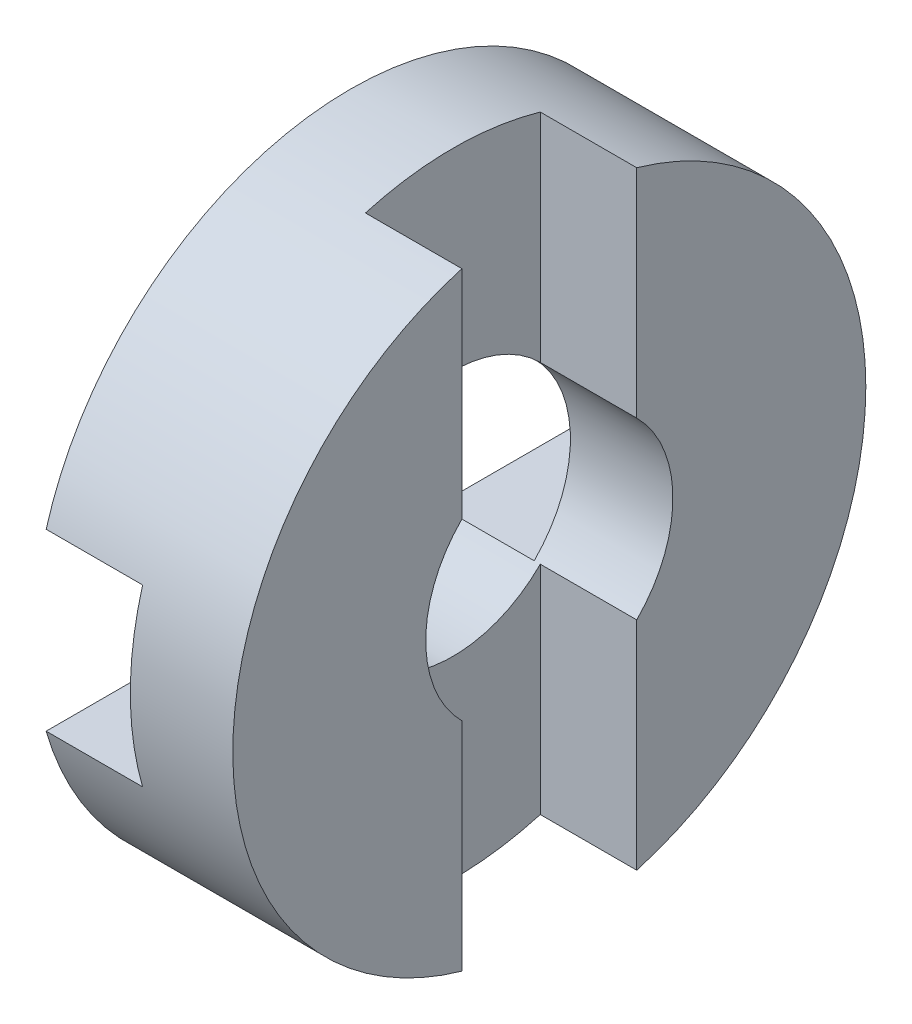
ISO-10303-21;
HEADER;
FILE_DESCRIPTION(('STEP AP214'),'2;1');
FILE_NAME('part.step','',(''),(''),'','','');
FILE_SCHEMA(('AUTOMOTIVE_DESIGN { 1 0 10303 214 1 1 1 1 }'));
ENDSEC;
DATA;
#1=APPLICATION_CONTEXT('core data for automotive mechanical design processes');
#2=APPLICATION_PROTOCOL_DEFINITION('international standard','automotive_design',2000,#1);
#3=PRODUCT_CONTEXT('',#1,'mechanical');
#4=PRODUCT('Part','Part','',(#3));
#5=PRODUCT_RELATED_PRODUCT_CATEGORY('part','',(#4));
#6=PRODUCT_DEFINITION_FORMATION('','',#4);
#7=PRODUCT_DEFINITION_CONTEXT('part definition',#1,'design');
#8=PRODUCT_DEFINITION('design','',#6,#7);
#9=PRODUCT_DEFINITION_SHAPE('','',#8);
#10=(LENGTH_UNIT() NAMED_UNIT(*) SI_UNIT(.MILLI.,.METRE.));
#11=(NAMED_UNIT(*) PLANE_ANGLE_UNIT() SI_UNIT($,.RADIAN.));
#12=(NAMED_UNIT(*) SI_UNIT($,.STERADIAN.) SOLID_ANGLE_UNIT());
#13=UNCERTAINTY_MEASURE_WITH_UNIT(LENGTH_MEASURE(1.E-05),#10,'distance_accuracy_value','');
#14=(GEOMETRIC_REPRESENTATION_CONTEXT(3) GLOBAL_UNCERTAINTY_ASSIGNED_CONTEXT((#13)) GLOBAL_UNIT_ASSIGNED_CONTEXT((#10,
#11,#12)) REPRESENTATION_CONTEXT('',''));
#15=CARTESIAN_POINT('',(0.,0.,0.));
#16=DIRECTION('',(0.,0.,1.));
#17=DIRECTION('',(1.,0.,0.));
#18=AXIS2_PLACEMENT_3D('',#15,#16,#17);
#19=CARTESIAN_POINT('',(6.6,0.,0.));
#20=DIRECTION('',(-1.,0.,0.));
#21=DIRECTION('',(0.,0.,1.));
#22=AXIS2_PLACEMENT_3D('',#19,#20,#21);
#23=CYLINDRICAL_SURFACE('',#22,10.5);
#24=CARTESIAN_POINT('',(3.2,0.,0.));
#25=DIRECTION('',(-1.,0.,0.));
#26=DIRECTION('',(0.,0.,1.));
#27=AXIS2_PLACEMENT_3D('',#24,#25,#26);
#28=CIRCLE('',#27,10.5);
#29=CARTESIAN_POINT('',(3.2,-2.9,10.0915806492343));
#30=VERTEX_POINT('',#29);
#31=CARTESIAN_POINT('',(3.2,2.9,10.0915806492343));
#32=VERTEX_POINT('',#31);
#33=EDGE_CURVE('E198',#30,#32,#28,.T.);
#34=ORIENTED_EDGE('',*,*,#33,.F.);
#35=DIRECTION('',(-1.,0.,0.));
#36=VECTOR('',#35,1.);
#37=CARTESIAN_POINT('',(6.6,-2.9,10.0915806492343));
#38=LINE('',#37,#36);
#39=CARTESIAN_POINT('',(0.,-2.9,10.0915806492343));
#40=VERTEX_POINT('',#39);
#41=EDGE_CURVE('E201',#40,#30,#38,.F.);
#42=ORIENTED_EDGE('',*,*,#41,.F.);
#43=CARTESIAN_POINT('',(0.,0.,0.));
#44=DIRECTION('',(-1.,0.,0.));
#45=DIRECTION('',(0.,0.,1.));
#46=AXIS2_PLACEMENT_3D('',#43,#44,#45);
#47=CIRCLE('',#46,10.5);
#48=CARTESIAN_POINT('',(0.,-2.9,-10.0915806492343));
#49=VERTEX_POINT('',#48);
#50=EDGE_CURVE('E215',#49,#40,#47,.T.);
#51=ORIENTED_EDGE('',*,*,#50,.F.);
#52=DIRECTION('',(-1.,0.,0.));
#53=VECTOR('',#52,1.);
#54=CARTESIAN_POINT('',(6.6,-2.9,-10.0915806492343));
#55=LINE('',#54,#53);
#56=CARTESIAN_POINT('',(3.2,-2.9,-10.0915806492343));
#57=VERTEX_POINT('',#56);
#58=EDGE_CURVE('E204',#57,#49,#55,.T.);
#59=ORIENTED_EDGE('',*,*,#58,.F.);
#60=CARTESIAN_POINT('',(3.2,2.9,-10.0915806492343));
#61=VERTEX_POINT('',#60);
#62=EDGE_CURVE('E199',#61,#57,#28,.T.);
#63=ORIENTED_EDGE('',*,*,#62,.F.);
#64=DIRECTION('',(-1.,0.,0.));
#65=VECTOR('',#64,1.);
#66=CARTESIAN_POINT('',(6.6,2.9,-10.0915806492343));
#67=LINE('',#66,#65);
#68=CARTESIAN_POINT('',(0.,2.9,-10.0915806492343));
#69=VERTEX_POINT('',#68);
#70=EDGE_CURVE('E194',#69,#61,#67,.F.);
#71=ORIENTED_EDGE('',*,*,#70,.F.);
#72=CARTESIAN_POINT('',(0.,2.9,10.0915806492343));
#73=VERTEX_POINT('',#72);
#74=EDGE_CURVE('E219',#73,#69,#47,.T.);
#75=ORIENTED_EDGE('',*,*,#74,.F.);
#76=DIRECTION('',(-1.,0.,0.));
#77=VECTOR('',#76,1.);
#78=CARTESIAN_POINT('',(6.6,2.9,10.0915806492343));
#79=LINE('',#78,#77);
#80=EDGE_CURVE('E196',#32,#73,#79,.T.);
#81=ORIENTED_EDGE('',*,*,#80,.F.);
#82=EDGE_LOOP('',(#34,#42,#51,#59,#63,#71,#75,#81));
#83=FACE_BOUND('',#82,.T.);
#84=DIRECTION('',(-1.,0.,0.));
#85=VECTOR('',#84,1.);
#86=CARTESIAN_POINT('',(6.6,10.0915806492343,-2.9));
#87=LINE('',#86,#85);
#88=CARTESIAN_POINT('',(6.6,10.0915806492343,-2.9));
#89=VERTEX_POINT('',#88);
#90=CARTESIAN_POINT('',(3.4,10.0915806492343,-2.9));
#91=VERTEX_POINT('',#90);
#92=EDGE_CURVE('E178',#89,#91,#87,.T.);
#93=ORIENTED_EDGE('',*,*,#92,.F.);
#94=CARTESIAN_POINT('',(6.6,0.,0.));
#95=DIRECTION('',(-1.,0.,0.));
#96=DIRECTION('',(0.,0.,1.));
#97=AXIS2_PLACEMENT_3D('',#94,#95,#96);
#98=CIRCLE('',#97,10.5);
#99=CARTESIAN_POINT('',(6.6,-10.0915806492343,-2.9));
#100=VERTEX_POINT('',#99);
#101=EDGE_CURVE('E207',#89,#100,#98,.T.);
#102=ORIENTED_EDGE('',*,*,#101,.T.);
#103=DIRECTION('',(-1.,0.,0.));
#104=VECTOR('',#103,1.);
#105=CARTESIAN_POINT('',(6.6,-10.0915806492343,-2.9));
#106=LINE('',#105,#104);
#107=CARTESIAN_POINT('',(3.4,-10.0915806492343,-2.9));
#108=VERTEX_POINT('',#107);
#109=EDGE_CURVE('E176',#108,#100,#106,.F.);
#110=ORIENTED_EDGE('',*,*,#109,.F.);
#111=CARTESIAN_POINT('',(3.4,0.,0.));
#112=DIRECTION('',(1.,0.,0.));
#113=DIRECTION('',(0.,0.,-1.));
#114=AXIS2_PLACEMENT_3D('',#111,#112,#113);
#115=CIRCLE('',#114,10.5);
#116=CARTESIAN_POINT('',(3.4,-10.0915806492343,2.9));
#117=VERTEX_POINT('',#116);
#118=EDGE_CURVE('E154',#117,#108,#115,.T.);
#119=ORIENTED_EDGE('',*,*,#118,.F.);
#120=DIRECTION('',(-1.,0.,0.));
#121=VECTOR('',#120,1.);
#122=CARTESIAN_POINT('',(6.6,-10.0915806492343,2.9));
#123=LINE('',#122,#121);
#124=CARTESIAN_POINT('',(6.6,-10.0915806492343,2.9));
#125=VERTEX_POINT('',#124);
#126=EDGE_CURVE('E166',#125,#117,#123,.T.);
#127=ORIENTED_EDGE('',*,*,#126,.F.);
#128=CARTESIAN_POINT('',(6.6,10.0915806492343,2.9));
#129=VERTEX_POINT('',#128);
#130=EDGE_CURVE('E165',#125,#129,#98,.T.);
#131=ORIENTED_EDGE('',*,*,#130,.T.);
#132=DIRECTION('',(-1.,0.,0.));
#133=VECTOR('',#132,1.);
#134=CARTESIAN_POINT('',(6.6,10.0915806492343,2.9));
#135=LINE('',#134,#133);
#136=CARTESIAN_POINT('',(3.4,10.0915806492343,2.9));
#137=VERTEX_POINT('',#136);
#138=EDGE_CURVE('E53',#137,#129,#135,.F.);
#139=ORIENTED_EDGE('',*,*,#138,.F.);
#140=EDGE_CURVE('E145',#91,#137,#115,.T.);
#141=ORIENTED_EDGE('',*,*,#140,.F.);
#142=EDGE_LOOP('',(#93,#102,#110,#119,#127,#131,#139,#141));
#143=FACE_BOUND('',#142,.T.);
#144=ADVANCED_FACE('F31',(#83,#143),#23,.T.);
#145=CARTESIAN_POINT('',(6.6,0.,0.));
#146=DIRECTION('',(-1.,0.,0.));
#147=DIRECTION('',(0.,0.,1.));
#148=AXIS2_PLACEMENT_3D('',#145,#146,#147);
#149=CYLINDRICAL_SURFACE('',#148,4.1);
#150=DIRECTION('',(-1.,0.,0.));
#151=VECTOR('',#150,1.);
#152=CARTESIAN_POINT('',(6.6,-2.9,2.89827534923789));
#153=LINE('',#152,#151);
#154=CARTESIAN_POINT('',(3.2,-2.9,2.89827534923789));
#155=VERTEX_POINT('',#154);
#156=CARTESIAN_POINT('',(0.,-2.9,2.89827534923789));
#157=VERTEX_POINT('',#156);
#158=EDGE_CURVE('E230',#155,#157,#153,.T.);
#159=ORIENTED_EDGE('',*,*,#158,.F.);
#160=CARTESIAN_POINT('',(3.2,0.,0.));
#161=DIRECTION('',(-1.,0.,0.));
#162=DIRECTION('',(0.,0.,1.));
#163=AXIS2_PLACEMENT_3D('',#160,#161,#162);
#164=CIRCLE('',#163,4.1);
#165=CARTESIAN_POINT('',(3.2,2.9,2.89827534923789));
#166=VERTEX_POINT('',#165);
#167=EDGE_CURVE('E226',#166,#155,#164,.F.);
#168=ORIENTED_EDGE('',*,*,#167,.F.);
#169=DIRECTION('',(-1.,0.,0.));
#170=VECTOR('',#169,1.);
#171=CARTESIAN_POINT('',(6.6,2.9,2.89827534923789));
#172=LINE('',#171,#170);
#173=CARTESIAN_POINT('',(0.,2.9,2.89827534923789));
#174=VERTEX_POINT('',#173);
#175=EDGE_CURVE('E228',#174,#166,#172,.F.);
#176=ORIENTED_EDGE('',*,*,#175,.F.);
#177=CARTESIAN_POINT('',(0.,0.,0.));
#178=DIRECTION('',(-1.,0.,0.));
#179=DIRECTION('',(0.,0.,1.));
#180=AXIS2_PLACEMENT_3D('',#177,#178,#179);
#181=CIRCLE('',#180,4.1);
#182=CARTESIAN_POINT('',(0.,2.9,-2.89827534923789));
#183=VERTEX_POINT('',#182);
#184=EDGE_CURVE('E212',#174,#183,#181,.T.);
#185=ORIENTED_EDGE('',*,*,#184,.T.);
#186=DIRECTION('',(-1.,0.,0.));
#187=VECTOR('',#186,1.);
#188=CARTESIAN_POINT('',(6.6,2.9,-2.89827534923789));
#189=LINE('',#188,#187);
#190=CARTESIAN_POINT('',(3.2,2.9,-2.89827534923789));
#191=VERTEX_POINT('',#190);
#192=EDGE_CURVE('E220',#191,#183,#189,.T.);
#193=ORIENTED_EDGE('',*,*,#192,.F.);
#194=CARTESIAN_POINT('',(3.2,-2.9,-2.89827534923789));
#195=VERTEX_POINT('',#194);
#196=EDGE_CURVE('E222',#195,#191,#164,.F.);
#197=ORIENTED_EDGE('',*,*,#196,.F.);
#198=DIRECTION('',(-1.,0.,0.));
#199=VECTOR('',#198,1.);
#200=CARTESIAN_POINT('',(6.6,-2.9,-2.89827534923789));
#201=LINE('',#200,#199);
#202=CARTESIAN_POINT('',(0.,-2.9,-2.89827534923789));
#203=VERTEX_POINT('',#202);
#204=EDGE_CURVE('E225',#203,#195,#201,.F.);
#205=ORIENTED_EDGE('',*,*,#204,.F.);
#206=EDGE_CURVE('E216',#203,#157,#181,.T.);
#207=ORIENTED_EDGE('',*,*,#206,.T.);
#208=EDGE_LOOP('',(#159,#168,#176,#185,#193,#197,#205,#207));
#209=FACE_BOUND('',#208,.T.);
#210=DIRECTION('',(-1.,0.,0.));
#211=VECTOR('',#210,1.);
#212=CARTESIAN_POINT('',(6.6,-2.89827534923789,-2.9));
#213=LINE('',#212,#211);
#214=CARTESIAN_POINT('',(6.6,-2.89827534923789,-2.9));
#215=VERTEX_POINT('',#214);
#216=CARTESIAN_POINT('',(3.4,-2.89827534923789,-2.9));
#217=VERTEX_POINT('',#216);
#218=EDGE_CURVE('E168',#215,#217,#213,.T.);
#219=ORIENTED_EDGE('',*,*,#218,.F.);
#220=CARTESIAN_POINT('',(6.6,0.,0.));
#221=DIRECTION('',(-1.,0.,0.));
#222=DIRECTION('',(0.,0.,1.));
#223=AXIS2_PLACEMENT_3D('',#220,#221,#222);
#224=CIRCLE('',#223,4.1);
#225=CARTESIAN_POINT('',(6.6,2.89827534923789,-2.9));
#226=VERTEX_POINT('',#225);
#227=EDGE_CURVE('E211',#226,#215,#224,.T.);
#228=ORIENTED_EDGE('',*,*,#227,.F.);
#229=DIRECTION('',(-1.,0.,0.));
#230=VECTOR('',#229,1.);
#231=CARTESIAN_POINT('',(6.6,2.89827534923789,-2.9));
#232=LINE('',#231,#230);
#233=CARTESIAN_POINT('',(3.4,2.89827534923789,-2.9));
#234=VERTEX_POINT('',#233);
#235=EDGE_CURVE('E174',#234,#226,#232,.F.);
#236=ORIENTED_EDGE('',*,*,#235,.F.);
#237=CARTESIAN_POINT('',(3.4,0.,0.));
#238=DIRECTION('',(1.,0.,0.));
#239=DIRECTION('',(0.,0.,-1.));
#240=AXIS2_PLACEMENT_3D('',#237,#238,#239);
#241=CIRCLE('',#240,4.1);
#242=CARTESIAN_POINT('',(3.4,2.89827534923789,2.9));
#243=VERTEX_POINT('',#242);
#244=EDGE_CURVE('E34',#243,#234,#241,.F.);
#245=ORIENTED_EDGE('',*,*,#244,.F.);
#246=DIRECTION('',(-1.,0.,0.));
#247=VECTOR('',#246,1.);
#248=CARTESIAN_POINT('',(6.6,2.89827534923789,2.9));
#249=LINE('',#248,#247);
#250=CARTESIAN_POINT('',(6.6,2.89827534923789,2.9));
#251=VERTEX_POINT('',#250);
#252=EDGE_CURVE('E158',#251,#243,#249,.T.);
#253=ORIENTED_EDGE('',*,*,#252,.F.);
#254=CARTESIAN_POINT('',(6.6,-2.89827534923789,2.9));
#255=VERTEX_POINT('',#254);
#256=EDGE_CURVE('E208',#255,#251,#224,.T.);
#257=ORIENTED_EDGE('',*,*,#256,.F.);
#258=DIRECTION('',(-1.,0.,0.));
#259=VECTOR('',#258,1.);
#260=CARTESIAN_POINT('',(6.6,-2.89827534923789,2.9));
#261=LINE('',#260,#259);
#262=CARTESIAN_POINT('',(3.4,-2.89827534923789,2.9));
#263=VERTEX_POINT('',#262);
#264=EDGE_CURVE('E45',#263,#255,#261,.F.);
#265=ORIENTED_EDGE('',*,*,#264,.F.);
#266=EDGE_CURVE('E11',#217,#263,#241,.F.);
#267=ORIENTED_EDGE('',*,*,#266,.F.);
#268=EDGE_LOOP('',(#219,#228,#236,#245,#253,#257,#265,#267));
#269=FACE_BOUND('',#268,.T.);
#270=ADVANCED_FACE('F242',(#209,#269),#149,.F.);
#271=CARTESIAN_POINT('',(6.6,4.1,0.));
#272=DIRECTION('',(-1.,0.,0.));
#273=DIRECTION('',(0.,0.,1.));
#274=AXIS2_PLACEMENT_3D('',#271,#272,#273);
#275=PLANE('',#274);
#276=DIRECTION('',(0.,1.,0.));
#277=VECTOR('',#276,1.);
#278=CARTESIAN_POINT('',(6.6,4.1,-2.9));
#279=LINE('',#278,#277);
#280=EDGE_CURVE('E235',#100,#215,#279,.T.);
#281=ORIENTED_EDGE('',*,*,#280,.F.);
#282=ORIENTED_EDGE('',*,*,#101,.F.);
#283=EDGE_CURVE('E234',#226,#89,#279,.T.);
#284=ORIENTED_EDGE('',*,*,#283,.F.);
#285=ORIENTED_EDGE('',*,*,#227,.T.);
#286=EDGE_LOOP('',(#281,#282,#284,#285));
#287=FACE_BOUND('',#286,.T.);
#288=ADVANCED_FACE('F318',(#287),#275,.F.);
#289=DIRECTION('',(0.,-1.,0.));
#290=VECTOR('',#289,1.);
#291=CARTESIAN_POINT('',(6.6,4.1,2.9));
#292=LINE('',#291,#290);
#293=EDGE_CURVE('E233',#129,#251,#292,.T.);
#294=ORIENTED_EDGE('',*,*,#293,.F.);
#295=ORIENTED_EDGE('',*,*,#130,.F.);
#296=EDGE_CURVE('E232',#255,#125,#292,.T.);
#297=ORIENTED_EDGE('',*,*,#296,.F.);
#298=ORIENTED_EDGE('',*,*,#256,.T.);
#299=EDGE_LOOP('',(#294,#295,#297,#298));
#300=FACE_BOUND('',#299,.T.);
#301=ADVANCED_FACE('F244',(#300),#275,.F.);
#302=CARTESIAN_POINT('',(0.,10.5,0.));
#303=DIRECTION('',(1.,0.,0.));
#304=DIRECTION('',(0.,0.,-1.));
#305=AXIS2_PLACEMENT_3D('',#302,#303,#304);
#306=PLANE('',#305);
#307=DIRECTION('',(0.,0.,-1.));
#308=VECTOR('',#307,1.);
#309=CARTESIAN_POINT('',(0.,-2.9,10.5));
#310=LINE('',#309,#308);
#311=EDGE_CURVE('E190',#203,#49,#310,.T.);
#312=ORIENTED_EDGE('',*,*,#311,.T.);
#313=ORIENTED_EDGE('',*,*,#50,.T.);
#314=EDGE_CURVE('E193',#40,#157,#310,.T.);
#315=ORIENTED_EDGE('',*,*,#314,.T.);
#316=ORIENTED_EDGE('',*,*,#206,.F.);
#317=EDGE_LOOP('',(#312,#313,#315,#316));
#318=FACE_BOUND('',#317,.T.);
#319=ADVANCED_FACE('F272',(#318),#306,.F.);
#320=DIRECTION('',(0.,0.,-1.));
#321=VECTOR('',#320,1.);
#322=CARTESIAN_POINT('',(0.,2.9,10.5));
#323=LINE('',#322,#321);
#324=EDGE_CURVE('E181',#73,#174,#323,.T.);
#325=ORIENTED_EDGE('',*,*,#324,.F.);
#326=ORIENTED_EDGE('',*,*,#74,.T.);
#327=EDGE_CURVE('E153',#183,#69,#323,.T.);
#328=ORIENTED_EDGE('',*,*,#327,.F.);
#329=ORIENTED_EDGE('',*,*,#184,.F.);
#330=EDGE_LOOP('',(#325,#326,#328,#329));
#331=FACE_BOUND('',#330,.T.);
#332=ADVANCED_FACE('F295',(#331),#306,.F.);
#333=CARTESIAN_POINT('',(3.2,2.9,10.5));
#334=DIRECTION('',(0.,-1.,0.));
#335=DIRECTION('',(0.,0.,-1.));
#336=AXIS2_PLACEMENT_3D('',#333,#334,#335);
#337=PLANE('',#336);
#338=ORIENTED_EDGE('',*,*,#70,.T.);
#339=DIRECTION('',(0.,0.,-1.));
#340=VECTOR('',#339,1.);
#341=CARTESIAN_POINT('',(3.2,2.9,10.5));
#342=LINE('',#341,#340);
#343=EDGE_CURVE('E182',#191,#61,#342,.T.);
#344=ORIENTED_EDGE('',*,*,#343,.F.);
#345=ORIENTED_EDGE('',*,*,#192,.T.);
#346=ORIENTED_EDGE('',*,*,#327,.T.);
#347=EDGE_LOOP('',(#338,#344,#345,#346));
#348=FACE_BOUND('',#347,.T.);
#349=ADVANCED_FACE('F299',(#348),#337,.T.);
#350=CARTESIAN_POINT('',(3.2,-2.9,10.5));
#351=DIRECTION('',(-1.,0.,0.));
#352=DIRECTION('',(0.,0.,1.));
#353=AXIS2_PLACEMENT_3D('',#350,#351,#352);
#354=PLANE('',#353);
#355=ORIENTED_EDGE('',*,*,#62,.T.);
#356=DIRECTION('',(0.,0.,-1.));
#357=VECTOR('',#356,1.);
#358=CARTESIAN_POINT('',(3.2,-2.9,10.5));
#359=LINE('',#358,#357);
#360=EDGE_CURVE('E186',#195,#57,#359,.T.);
#361=ORIENTED_EDGE('',*,*,#360,.F.);
#362=ORIENTED_EDGE('',*,*,#196,.T.);
#363=ORIENTED_EDGE('',*,*,#343,.T.);
#364=EDGE_LOOP('',(#355,#361,#362,#363));
#365=FACE_BOUND('',#364,.T.);
#366=ADVANCED_FACE('F303',(#365),#354,.T.);
#367=CARTESIAN_POINT('',(0.,-2.9,10.5));
#368=DIRECTION('',(0.,1.,0.));
#369=DIRECTION('',(0.,0.,1.));
#370=AXIS2_PLACEMENT_3D('',#367,#368,#369);
#371=PLANE('',#370);
#372=ORIENTED_EDGE('',*,*,#58,.T.);
#373=ORIENTED_EDGE('',*,*,#311,.F.);
#374=ORIENTED_EDGE('',*,*,#204,.T.);
#375=ORIENTED_EDGE('',*,*,#360,.T.);
#376=EDGE_LOOP('',(#372,#373,#374,#375));
#377=FACE_BOUND('',#376,.T.);
#378=ADVANCED_FACE('F305',(#377),#371,.T.);
#379=ORIENTED_EDGE('',*,*,#41,.T.);
#380=EDGE_CURVE('E189',#30,#155,#359,.T.);
#381=ORIENTED_EDGE('',*,*,#380,.T.);
#382=ORIENTED_EDGE('',*,*,#158,.T.);
#383=ORIENTED_EDGE('',*,*,#314,.F.);
#384=EDGE_LOOP('',(#379,#381,#382,#383));
#385=FACE_BOUND('',#384,.T.);
#386=ADVANCED_FACE('F276',(#385),#371,.T.);
#387=ORIENTED_EDGE('',*,*,#33,.T.);
#388=EDGE_CURVE('E185',#32,#166,#342,.T.);
#389=ORIENTED_EDGE('',*,*,#388,.T.);
#390=ORIENTED_EDGE('',*,*,#167,.T.);
#391=ORIENTED_EDGE('',*,*,#380,.F.);
#392=EDGE_LOOP('',(#387,#389,#390,#391));
#393=FACE_BOUND('',#392,.T.);
#394=ADVANCED_FACE('F286',(#393),#354,.T.);
#395=ORIENTED_EDGE('',*,*,#80,.T.);
#396=ORIENTED_EDGE('',*,*,#324,.T.);
#397=ORIENTED_EDGE('',*,*,#175,.T.);
#398=ORIENTED_EDGE('',*,*,#388,.F.);
#399=EDGE_LOOP('',(#395,#396,#397,#398));
#400=FACE_BOUND('',#399,.T.);
#401=ADVANCED_FACE('F288',(#400),#337,.T.);
#402=CARTESIAN_POINT('',(6.6,10.5,-2.9));
#403=DIRECTION('',(0.,0.,1.));
#404=DIRECTION('',(1.,0.,0.));
#405=AXIS2_PLACEMENT_3D('',#402,#403,#404);
#406=PLANE('',#405);
#407=ORIENTED_EDGE('',*,*,#109,.T.);
#408=ORIENTED_EDGE('',*,*,#280,.T.);
#409=ORIENTED_EDGE('',*,*,#218,.T.);
#410=DIRECTION('',(0.,-1.,0.));
#411=VECTOR('',#410,1.);
#412=CARTESIAN_POINT('',(3.4,10.5,-2.9));
#413=LINE('',#412,#411);
#414=EDGE_CURVE('E159',#217,#108,#413,.T.);
#415=ORIENTED_EDGE('',*,*,#414,.T.);
#416=EDGE_LOOP('',(#407,#408,#409,#415));
#417=FACE_BOUND('',#416,.T.);
#418=ADVANCED_FACE('F256',(#417),#406,.T.);
#419=CARTESIAN_POINT('',(3.4,10.5,2.9));
#420=DIRECTION('',(0.,0.,-1.));
#421=DIRECTION('',(-1.,0.,0.));
#422=AXIS2_PLACEMENT_3D('',#419,#420,#421);
#423=PLANE('',#422);
#424=ORIENTED_EDGE('',*,*,#126,.T.);
#425=DIRECTION('',(0.,-1.,0.));
#426=VECTOR('',#425,1.);
#427=CARTESIAN_POINT('',(3.4,10.5,2.9));
#428=LINE('',#427,#426);
#429=EDGE_CURVE('E160',#263,#117,#428,.T.);
#430=ORIENTED_EDGE('',*,*,#429,.F.);
#431=ORIENTED_EDGE('',*,*,#264,.T.);
#432=ORIENTED_EDGE('',*,*,#296,.T.);
#433=EDGE_LOOP('',(#424,#430,#431,#432));
#434=FACE_BOUND('',#433,.T.);
#435=ADVANCED_FACE('F245',(#434),#423,.T.);
#436=CARTESIAN_POINT('',(3.4,10.5,-2.9));
#437=DIRECTION('',(1.,0.,0.));
#438=DIRECTION('',(0.,0.,-1.));
#439=AXIS2_PLACEMENT_3D('',#436,#437,#438);
#440=PLANE('',#439);
#441=ORIENTED_EDGE('',*,*,#118,.T.);
#442=ORIENTED_EDGE('',*,*,#414,.F.);
#443=ORIENTED_EDGE('',*,*,#266,.T.);
#444=ORIENTED_EDGE('',*,*,#429,.T.);
#445=EDGE_LOOP('',(#441,#442,#443,#444));
#446=FACE_BOUND('',#445,.T.);
#447=ADVANCED_FACE('F253',(#446),#440,.T.);
#448=ORIENTED_EDGE('',*,*,#140,.T.);
#449=EDGE_CURVE('E147',#137,#243,#428,.T.);
#450=ORIENTED_EDGE('',*,*,#449,.T.);
#451=ORIENTED_EDGE('',*,*,#244,.T.);
#452=EDGE_CURVE('E150',#91,#234,#413,.T.);
#453=ORIENTED_EDGE('',*,*,#452,.F.);
#454=EDGE_LOOP('',(#448,#450,#451,#453));
#455=FACE_BOUND('',#454,.T.);
#456=ADVANCED_FACE('F146',(#455),#440,.T.);
#457=ORIENTED_EDGE('',*,*,#92,.T.);
#458=ORIENTED_EDGE('',*,*,#452,.T.);
#459=ORIENTED_EDGE('',*,*,#235,.T.);
#460=ORIENTED_EDGE('',*,*,#283,.T.);
#461=EDGE_LOOP('',(#457,#458,#459,#460));
#462=FACE_BOUND('',#461,.T.);
#463=ADVANCED_FACE('F259',(#462),#406,.T.);
#464=ORIENTED_EDGE('',*,*,#138,.T.);
#465=ORIENTED_EDGE('',*,*,#293,.T.);
#466=ORIENTED_EDGE('',*,*,#252,.T.);
#467=ORIENTED_EDGE('',*,*,#449,.F.);
#468=EDGE_LOOP('',(#464,#465,#466,#467));
#469=FACE_BOUND('',#468,.T.);
#470=ADVANCED_FACE('F156',(#469),#423,.T.);
#471=CLOSED_SHELL('',(#144,#270,#288,#301,#319,#332,#349,#366,#378,#386,#394,#401,#418,#435,
#447,#456,#463,#470));
#472=MANIFOLD_SOLID_BREP('B2',#471);
#473=ADVANCED_BREP_SHAPE_REPRESENTATION('',(#18,#472),#14);
#474=SHAPE_DEFINITION_REPRESENTATION(#9,#473);
ENDSEC;
END-ISO-10303-21;
